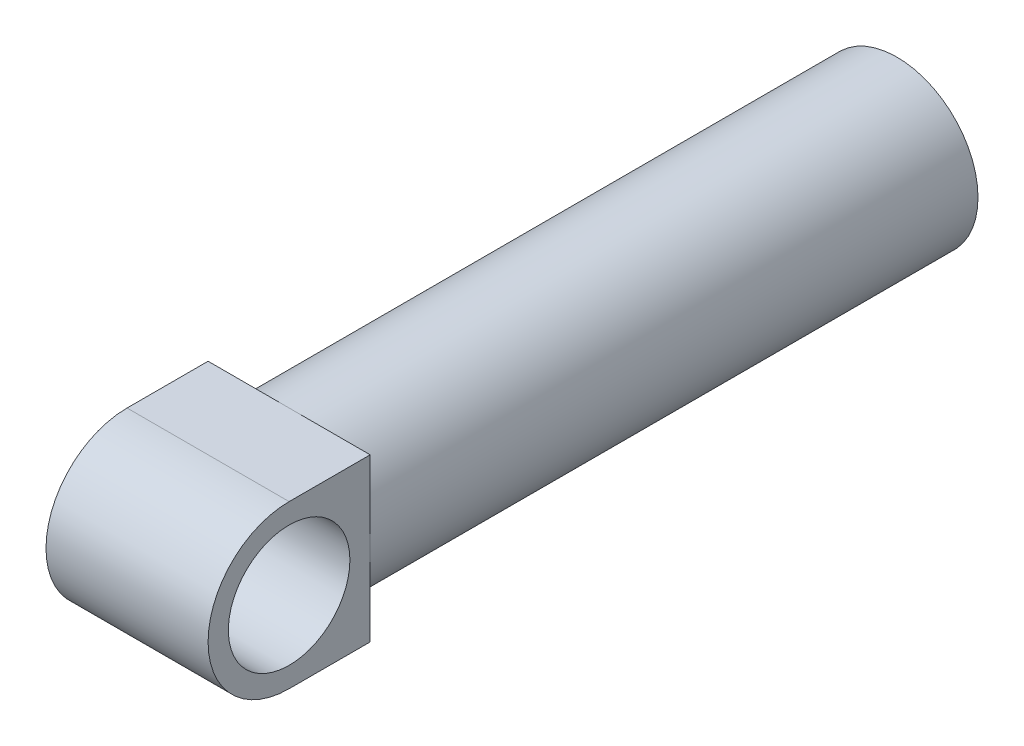
ISO-10303-21;
HEADER;
FILE_DESCRIPTION(('STEP AP214'),'2;1');
FILE_NAME('part.step','',(''),(''),'','','');
FILE_SCHEMA(('AUTOMOTIVE_DESIGN { 1 0 10303 214 1 1 1 1 }'));
ENDSEC;
DATA;
#1=APPLICATION_CONTEXT('core data for automotive mechanical design processes');
#2=APPLICATION_PROTOCOL_DEFINITION('international standard','automotive_design',2000,#1);
#3=PRODUCT_CONTEXT('',#1,'mechanical');
#4=PRODUCT('Part','Part','',(#3));
#5=PRODUCT_RELATED_PRODUCT_CATEGORY('part','',(#4));
#6=PRODUCT_DEFINITION_FORMATION('','',#4);
#7=PRODUCT_DEFINITION_CONTEXT('part definition',#1,'design');
#8=PRODUCT_DEFINITION('design','',#6,#7);
#9=PRODUCT_DEFINITION_SHAPE('','',#8);
#10=(LENGTH_UNIT() NAMED_UNIT(*) SI_UNIT(.MILLI.,.METRE.));
#11=(NAMED_UNIT(*) PLANE_ANGLE_UNIT() SI_UNIT($,.RADIAN.));
#12=(NAMED_UNIT(*) SI_UNIT($,.STERADIAN.) SOLID_ANGLE_UNIT());
#13=UNCERTAINTY_MEASURE_WITH_UNIT(LENGTH_MEASURE(1.E-05),#10,'distance_accuracy_value','');
#14=(GEOMETRIC_REPRESENTATION_CONTEXT(3) GLOBAL_UNCERTAINTY_ASSIGNED_CONTEXT((#13)) GLOBAL_UNIT_ASSIGNED_CONTEXT((#10,
#11,#12)) REPRESENTATION_CONTEXT('',''));
#15=CARTESIAN_POINT('',(0.,0.,0.));
#16=DIRECTION('',(0.,0.,1.));
#17=DIRECTION('',(1.,0.,0.));
#18=AXIS2_PLACEMENT_3D('',#15,#16,#17);
#19=CARTESIAN_POINT('',(0.,0.,300.));
#20=DIRECTION('',(0.,0.,-1.));
#21=DIRECTION('',(-1.,0.,0.));
#22=AXIS2_PLACEMENT_3D('',#19,#20,#21);
#23=CYLINDRICAL_SURFACE('',#22,40.);
#24=CARTESIAN_POINT('',(0.,0.,300.));
#25=DIRECTION('',(0.,0.,1.));
#26=DIRECTION('',(1.,0.,0.));
#27=AXIS2_PLACEMENT_3D('',#24,#25,#26);
#28=CIRCLE('',#27,40.);
#29=CARTESIAN_POINT('',(40.,0.,300.));
#30=VERTEX_POINT('',#29);
#31=CARTESIAN_POINT('',(0.,40.,300.));
#32=VERTEX_POINT('',#31);
#33=EDGE_CURVE('E11',#30,#32,#28,.T.);
#34=ORIENTED_EDGE('',*,*,#33,.F.);
#35=CARTESIAN_POINT('',(0.,-40.,300.));
#36=VERTEX_POINT('',#35);
#37=EDGE_CURVE('E42',#36,#30,#28,.T.);
#38=ORIENTED_EDGE('',*,*,#37,.F.);
#39=CARTESIAN_POINT('',(-40.,0.,300.));
#40=VERTEX_POINT('',#39);
#41=EDGE_CURVE('E52',#40,#36,#28,.T.);
#42=ORIENTED_EDGE('',*,*,#41,.F.);
#43=EDGE_CURVE('E41',#32,#40,#28,.T.);
#44=ORIENTED_EDGE('',*,*,#43,.F.);
#45=EDGE_LOOP('',(#34,#38,#42,#44));
#46=FACE_BOUND('',#45,.T.);
#47=CARTESIAN_POINT('',(0.,0.,0.));
#48=DIRECTION('',(0.,0.,1.));
#49=DIRECTION('',(1.,0.,0.));
#50=AXIS2_PLACEMENT_3D('',#47,#48,#49);
#51=CIRCLE('',#50,40.);
#52=CARTESIAN_POINT('',(40.,0.,0.));
#53=VERTEX_POINT('',#52);
#54=EDGE_CURVE('E36',#53,#53,#51,.T.);
#55=ORIENTED_EDGE('',*,*,#54,.T.);
#56=EDGE_LOOP('',(#55));
#57=FACE_BOUND('',#56,.T.);
#58=ADVANCED_FACE('F33',(#46,#57),#23,.T.);
#59=CARTESIAN_POINT('',(0.,0.,0.));
#60=DIRECTION('',(0.,0.,1.));
#61=DIRECTION('',(1.,0.,0.));
#62=AXIS2_PLACEMENT_3D('',#59,#60,#61);
#63=PLANE('',#62);
#64=ORIENTED_EDGE('',*,*,#54,.F.);
#65=EDGE_LOOP('',(#64));
#66=FACE_BOUND('',#65,.T.);
#67=ADVANCED_FACE('F160',(#66),#63,.F.);
#68=CARTESIAN_POINT('',(40.,-40.,300.));
#69=DIRECTION('',(0.,0.,1.));
#70=DIRECTION('',(1.,0.,0.));
#71=AXIS2_PLACEMENT_3D('',#68,#69,#70);
#72=PLANE('',#71);
#73=DIRECTION('',(0.,1.,0.));
#74=VECTOR('',#73,1.);
#75=CARTESIAN_POINT('',(40.,-40.,300.));
#76=LINE('',#75,#74);
#77=CARTESIAN_POINT('',(40.,40.,300.));
#78=VERTEX_POINT('',#77);
#79=EDGE_CURVE('E101',#30,#78,#76,.T.);
#80=ORIENTED_EDGE('',*,*,#79,.F.);
#81=ORIENTED_EDGE('',*,*,#33,.T.);
#82=DIRECTION('',(-1.,0.,0.));
#83=VECTOR('',#82,1.);
#84=CARTESIAN_POINT('',(40.,40.,300.));
#85=LINE('',#84,#83);
#86=EDGE_CURVE('E118',#78,#32,#85,.T.);
#87=ORIENTED_EDGE('',*,*,#86,.F.);
#88=EDGE_LOOP('',(#80,#81,#87));
#89=FACE_BOUND('',#88,.T.);
#90=ADVANCED_FACE('F164',(#89),#72,.F.);
#91=CARTESIAN_POINT('',(-40.,40.,300.));
#92=VERTEX_POINT('',#91);
#93=EDGE_CURVE('E120',#32,#92,#85,.T.);
#94=ORIENTED_EDGE('',*,*,#93,.F.);
#95=ORIENTED_EDGE('',*,*,#43,.T.);
#96=DIRECTION('',(0.,1.,0.));
#97=VECTOR('',#96,1.);
#98=CARTESIAN_POINT('',(-40.,-40.,300.));
#99=LINE('',#98,#97);
#100=EDGE_CURVE('E123',#40,#92,#99,.T.);
#101=ORIENTED_EDGE('',*,*,#100,.T.);
#102=EDGE_LOOP('',(#94,#95,#101));
#103=FACE_BOUND('',#102,.T.);
#104=ADVANCED_FACE('F182',(#103),#72,.F.);
#105=CARTESIAN_POINT('',(-40.,-40.,300.));
#106=VERTEX_POINT('',#105);
#107=EDGE_CURVE('E105',#106,#40,#99,.T.);
#108=ORIENTED_EDGE('',*,*,#107,.T.);
#109=ORIENTED_EDGE('',*,*,#41,.T.);
#110=DIRECTION('',(-1.,0.,0.));
#111=VECTOR('',#110,1.);
#112=CARTESIAN_POINT('',(40.,-40.,300.));
#113=LINE('',#112,#111);
#114=EDGE_CURVE('E117',#36,#106,#113,.T.);
#115=ORIENTED_EDGE('',*,*,#114,.T.);
#116=EDGE_LOOP('',(#108,#109,#115));
#117=FACE_BOUND('',#116,.T.);
#118=ADVANCED_FACE('F178',(#117),#72,.F.);
#119=CARTESIAN_POINT('',(40.,-40.,300.));
#120=VERTEX_POINT('',#119);
#121=EDGE_CURVE('E112',#120,#36,#113,.T.);
#122=ORIENTED_EDGE('',*,*,#121,.T.);
#123=ORIENTED_EDGE('',*,*,#37,.T.);
#124=EDGE_CURVE('E131',#120,#30,#76,.T.);
#125=ORIENTED_EDGE('',*,*,#124,.F.);
#126=EDGE_LOOP('',(#122,#123,#125));
#127=FACE_BOUND('',#126,.T.);
#128=ADVANCED_FACE('F172',(#127),#72,.F.);
#129=CARTESIAN_POINT('',(40.,40.,300.));
#130=DIRECTION('',(0.,-1.,0.));
#131=DIRECTION('',(0.,0.,-1.));
#132=AXIS2_PLACEMENT_3D('',#129,#130,#131);
#133=PLANE('',#132);
#134=DIRECTION('',(0.,0.,1.));
#135=VECTOR('',#134,1.);
#136=CARTESIAN_POINT('',(-40.,40.,300.));
#137=LINE('',#136,#135);
#138=CARTESIAN_POINT('',(-40.,40.,340.));
#139=VERTEX_POINT('',#138);
#140=EDGE_CURVE('E109',#92,#139,#137,.T.);
#141=ORIENTED_EDGE('',*,*,#140,.T.);
#142=DIRECTION('',(-1.,0.,0.));
#143=VECTOR('',#142,1.);
#144=CARTESIAN_POINT('',(40.,40.,340.));
#145=LINE('',#144,#143);
#146=CARTESIAN_POINT('',(40.,40.,340.));
#147=VERTEX_POINT('',#146);
#148=EDGE_CURVE('E88',#147,#139,#145,.T.);
#149=ORIENTED_EDGE('',*,*,#148,.F.);
#150=DIRECTION('',(0.,0.,1.));
#151=VECTOR('',#150,1.);
#152=CARTESIAN_POINT('',(40.,40.,300.));
#153=LINE('',#152,#151);
#154=EDGE_CURVE('E95',#78,#147,#153,.T.);
#155=ORIENTED_EDGE('',*,*,#154,.F.);
#156=ORIENTED_EDGE('',*,*,#86,.T.);
#157=ORIENTED_EDGE('',*,*,#93,.T.);
#158=EDGE_LOOP('',(#141,#149,#155,#156,#157));
#159=FACE_BOUND('',#158,.T.);
#160=ADVANCED_FACE('F107',(#159),#133,.F.);
#161=CARTESIAN_POINT('',(40.,0.,340.));
#162=DIRECTION('',(-1.,0.,0.));
#163=DIRECTION('',(0.,0.,1.));
#164=AXIS2_PLACEMENT_3D('',#161,#162,#163);
#165=CYLINDRICAL_SURFACE('',#164,40.);
#166=CARTESIAN_POINT('',(-40.,0.,340.));
#167=DIRECTION('',(1.,0.,0.));
#168=DIRECTION('',(0.,0.,-1.));
#169=AXIS2_PLACEMENT_3D('',#166,#167,#168);
#170=CIRCLE('',#169,40.);
#171=CARTESIAN_POINT('',(-40.,-40.,340.));
#172=VERTEX_POINT('',#171);
#173=EDGE_CURVE('E127',#139,#172,#170,.T.);
#174=ORIENTED_EDGE('',*,*,#173,.T.);
#175=DIRECTION('',(-1.,0.,0.));
#176=VECTOR('',#175,1.);
#177=CARTESIAN_POINT('',(40.,-40.,340.));
#178=LINE('',#177,#176);
#179=CARTESIAN_POINT('',(40.,-40.,340.));
#180=VERTEX_POINT('',#179);
#181=EDGE_CURVE('E91',#180,#172,#178,.T.);
#182=ORIENTED_EDGE('',*,*,#181,.F.);
#183=CARTESIAN_POINT('',(40.,0.,340.));
#184=DIRECTION('',(1.,0.,0.));
#185=DIRECTION('',(0.,0.,-1.));
#186=AXIS2_PLACEMENT_3D('',#183,#184,#185);
#187=CIRCLE('',#186,40.);
#188=EDGE_CURVE('E84',#147,#180,#187,.T.);
#189=ORIENTED_EDGE('',*,*,#188,.F.);
#190=ORIENTED_EDGE('',*,*,#148,.T.);
#191=EDGE_LOOP('',(#174,#182,#189,#190));
#192=FACE_BOUND('',#191,.T.);
#193=ADVANCED_FACE('F86',(#192),#165,.T.);
#194=CARTESIAN_POINT('',(40.,-40.,340.));
#195=DIRECTION('',(0.,1.,0.));
#196=DIRECTION('',(0.,0.,1.));
#197=AXIS2_PLACEMENT_3D('',#194,#195,#196);
#198=PLANE('',#197);
#199=DIRECTION('',(0.,0.,-1.));
#200=VECTOR('',#199,1.);
#201=CARTESIAN_POINT('',(-40.,-40.,340.));
#202=LINE('',#201,#200);
#203=EDGE_CURVE('E124',#172,#106,#202,.T.);
#204=ORIENTED_EDGE('',*,*,#203,.T.);
#205=ORIENTED_EDGE('',*,*,#114,.F.);
#206=ORIENTED_EDGE('',*,*,#121,.F.);
#207=DIRECTION('',(0.,0.,-1.));
#208=VECTOR('',#207,1.);
#209=CARTESIAN_POINT('',(40.,-40.,340.));
#210=LINE('',#209,#208);
#211=EDGE_CURVE('E94',#180,#120,#210,.T.);
#212=ORIENTED_EDGE('',*,*,#211,.F.);
#213=ORIENTED_EDGE('',*,*,#181,.T.);
#214=EDGE_LOOP('',(#204,#205,#206,#212,#213));
#215=FACE_BOUND('',#214,.T.);
#216=ADVANCED_FACE('F150',(#215),#198,.F.);
#217=CARTESIAN_POINT('',(40.,0.,340.));
#218=DIRECTION('',(1.,0.,0.));
#219=DIRECTION('',(0.,0.,-1.));
#220=AXIS2_PLACEMENT_3D('',#217,#218,#219);
#221=PLANE('',#220);
#222=CARTESIAN_POINT('',(40.,0.,340.));
#223=DIRECTION('',(1.,0.,0.));
#224=DIRECTION('',(0.,0.,-1.));
#225=AXIS2_PLACEMENT_3D('',#222,#223,#224);
#226=CIRCLE('',#225,30.);
#227=CARTESIAN_POINT('',(40.,0.,310.));
#228=VERTEX_POINT('',#227);
#229=EDGE_CURVE('E134',#228,#228,#226,.T.);
#230=ORIENTED_EDGE('',*,*,#229,.F.);
#231=EDGE_LOOP('',(#230));
#232=FACE_BOUND('',#231,.T.);
#233=ORIENTED_EDGE('',*,*,#154,.T.);
#234=ORIENTED_EDGE('',*,*,#188,.T.);
#235=ORIENTED_EDGE('',*,*,#211,.T.);
#236=ORIENTED_EDGE('',*,*,#124,.T.);
#237=ORIENTED_EDGE('',*,*,#79,.T.);
#238=EDGE_LOOP('',(#233,#234,#235,#236,#237));
#239=FACE_BOUND('',#238,.T.);
#240=ADVANCED_FACE('F98',(#232,#239),#221,.T.);
#241=CARTESIAN_POINT('',(-40.,0.,340.));
#242=DIRECTION('',(1.,0.,0.));
#243=DIRECTION('',(0.,0.,-1.));
#244=AXIS2_PLACEMENT_3D('',#241,#242,#243);
#245=PLANE('',#244);
#246=CARTESIAN_POINT('',(-40.,0.,340.));
#247=DIRECTION('',(1.,0.,0.));
#248=DIRECTION('',(0.,0.,-1.));
#249=AXIS2_PLACEMENT_3D('',#246,#247,#248);
#250=CIRCLE('',#249,30.);
#251=CARTESIAN_POINT('',(-40.,0.,310.));
#252=VERTEX_POINT('',#251);
#253=EDGE_CURVE('E130',#252,#252,#250,.T.);
#254=ORIENTED_EDGE('',*,*,#253,.T.);
#255=EDGE_LOOP('',(#254));
#256=FACE_BOUND('',#255,.T.);
#257=ORIENTED_EDGE('',*,*,#140,.F.);
#258=ORIENTED_EDGE('',*,*,#100,.F.);
#259=ORIENTED_EDGE('',*,*,#107,.F.);
#260=ORIENTED_EDGE('',*,*,#203,.F.);
#261=ORIENTED_EDGE('',*,*,#173,.F.);
#262=EDGE_LOOP('',(#257,#258,#259,#260,#261));
#263=FACE_BOUND('',#262,.T.);
#264=ADVANCED_FACE('F140',(#256,#263),#245,.F.);
#265=CARTESIAN_POINT('',(-40.,0.,340.));
#266=DIRECTION('',(1.,0.,0.));
#267=DIRECTION('',(0.,0.,-1.));
#268=AXIS2_PLACEMENT_3D('',#265,#266,#267);
#269=CYLINDRICAL_SURFACE('',#268,30.);
#270=ORIENTED_EDGE('',*,*,#253,.F.);
#271=EDGE_LOOP('',(#270));
#272=FACE_BOUND('',#271,.T.);
#273=ORIENTED_EDGE('',*,*,#229,.T.);
#274=EDGE_LOOP('',(#273));
#275=FACE_BOUND('',#274,.T.);
#276=ADVANCED_FACE('F143',(#272,#275),#269,.F.);
#277=CLOSED_SHELL('',(#58,#67,#90,#104,#118,#128,#160,#193,#216,#240,#264,#276));
#278=MANIFOLD_SOLID_BREP('B2',#277);
#279=ADVANCED_BREP_SHAPE_REPRESENTATION('',(#18,#278),#14);
#280=SHAPE_DEFINITION_REPRESENTATION(#9,#279);
ENDSEC;
END-ISO-10303-21;
